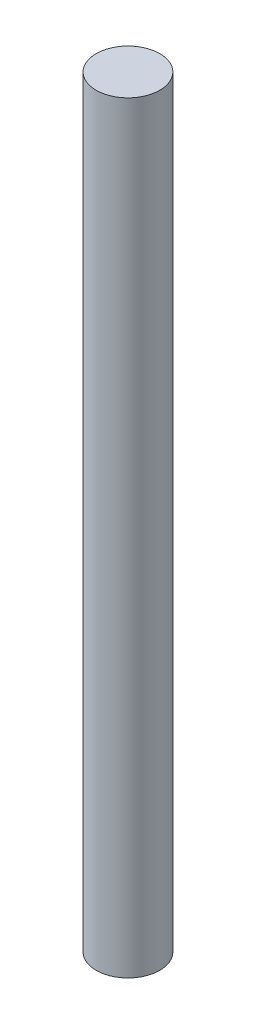
ISO-10303-21;
HEADER;
FILE_DESCRIPTION(('STEP AP214'),'2;1');
FILE_NAME('part.step','',(''),(''),'','','');
FILE_SCHEMA(('AUTOMOTIVE_DESIGN { 1 0 10303 214 1 1 1 1 }'));
ENDSEC;
DATA;
#1=APPLICATION_CONTEXT('core data for automotive mechanical design processes');
#2=APPLICATION_PROTOCOL_DEFINITION('international standard','automotive_design',2000,#1);
#3=PRODUCT_CONTEXT('',#1,'mechanical');
#4=PRODUCT('Part','Part','',(#3));
#5=PRODUCT_RELATED_PRODUCT_CATEGORY('part','',(#4));
#6=PRODUCT_DEFINITION_FORMATION('','',#4);
#7=PRODUCT_DEFINITION_CONTEXT('part definition',#1,'design');
#8=PRODUCT_DEFINITION('design','',#6,#7);
#9=PRODUCT_DEFINITION_SHAPE('','',#8);
#10=(LENGTH_UNIT() NAMED_UNIT(*) SI_UNIT(.MILLI.,.METRE.));
#11=(NAMED_UNIT(*) PLANE_ANGLE_UNIT() SI_UNIT($,.RADIAN.));
#12=(NAMED_UNIT(*) SI_UNIT($,.STERADIAN.) SOLID_ANGLE_UNIT());
#13=UNCERTAINTY_MEASURE_WITH_UNIT(LENGTH_MEASURE(1.E-05),#10,'distance_accuracy_value','');
#14=(GEOMETRIC_REPRESENTATION_CONTEXT(3) GLOBAL_UNCERTAINTY_ASSIGNED_CONTEXT((#13)) GLOBAL_UNIT_ASSIGNED_CONTEXT((#10,
#11,#12)) REPRESENTATION_CONTEXT('',''));
#15=CARTESIAN_POINT('',(0.,0.,0.));
#16=DIRECTION('',(0.,0.,1.));
#17=DIRECTION('',(1.,0.,0.));
#18=AXIS2_PLACEMENT_3D('',#15,#16,#17);
#19=CARTESIAN_POINT('',(0.,-38.1,0.));
#20=DIRECTION('',(0.,1.,0.));
#21=DIRECTION('',(0.,0.,1.));
#22=AXIS2_PLACEMENT_3D('',#19,#20,#21);
#23=CYLINDRICAL_SURFACE('',#22,1.5875);
#24=CARTESIAN_POINT('',(0.,-38.1,0.));
#25=DIRECTION('',(0.,1.,0.));
#26=DIRECTION('',(0.,0.,1.));
#27=AXIS2_PLACEMENT_3D('',#24,#25,#26);
#28=CIRCLE('',#27,1.5875);
#29=CARTESIAN_POINT('',(0.,-38.1,1.5875));
#30=VERTEX_POINT('',#29);
#31=EDGE_CURVE('E10',#30,#30,#28,.T.);
#32=ORIENTED_EDGE('',*,*,#31,.T.);
#33=EDGE_LOOP('',(#32));
#34=FACE_BOUND('',#33,.T.);
#35=CARTESIAN_POINT('',(0.,0.,0.));
#36=DIRECTION('',(0.,1.,0.));
#37=DIRECTION('',(0.,0.,1.));
#38=AXIS2_PLACEMENT_3D('',#35,#36,#37);
#39=CIRCLE('',#38,1.5875);
#40=CARTESIAN_POINT('',(0.,0.,1.5875));
#41=VERTEX_POINT('',#40);
#42=EDGE_CURVE('E364',#41,#41,#39,.T.);
#43=ORIENTED_EDGE('',*,*,#42,.F.);
#44=EDGE_LOOP('',(#43));
#45=FACE_BOUND('',#44,.T.);
#46=ADVANCED_FACE('F358',(#34,#45),#23,.T.);
#47=CARTESIAN_POINT('',(0.,-38.1,0.));
#48=DIRECTION('',(0.,1.,0.));
#49=DIRECTION('',(0.,0.,1.));
#50=AXIS2_PLACEMENT_3D('',#47,#48,#49);
#51=PLANE('',#50);
#52=ORIENTED_EDGE('',*,*,#31,.F.);
#53=EDGE_LOOP('',(#52));
#54=FACE_BOUND('',#53,.T.);
#55=ADVANCED_FACE('F373',(#54),#51,.F.);
#56=CARTESIAN_POINT('',(0.,0.,0.));
#57=DIRECTION('',(0.,1.,0.));
#58=DIRECTION('',(0.,0.,1.));
#59=AXIS2_PLACEMENT_3D('',#56,#57,#58);
#60=PLANE('',#59);
#61=ORIENTED_EDGE('',*,*,#42,.T.);
#62=EDGE_LOOP('',(#61));
#63=FACE_BOUND('',#62,.T.);
#64=ADVANCED_FACE('F370',(#63),#60,.T.);
#65=CLOSED_SHELL('',(#46,#55,#64));
#66=MANIFOLD_SOLID_BREP('B2',#65);
#67=ADVANCED_BREP_SHAPE_REPRESENTATION('',(#18,#66),#14);
#68=SHAPE_DEFINITION_REPRESENTATION(#9,#67);
ENDSEC;
END-ISO-10303-21;
